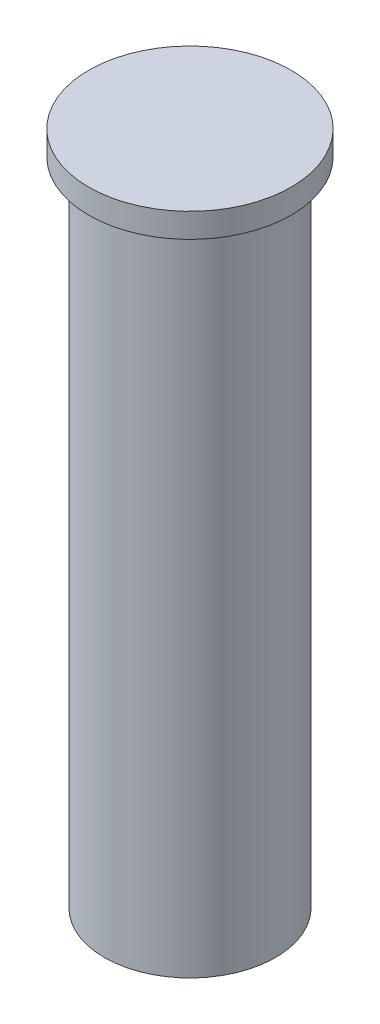
ISO-10303-21;
HEADER;
FILE_DESCRIPTION(('STEP AP214'),'2;1');
FILE_NAME('part.step','',(''),(''),'','','');
FILE_SCHEMA(('AUTOMOTIVE_DESIGN { 1 0 10303 214 1 1 1 1 }'));
ENDSEC;
DATA;
#1=APPLICATION_CONTEXT('core data for automotive mechanical design processes');
#2=APPLICATION_PROTOCOL_DEFINITION('international standard','automotive_design',2000,#1);
#3=PRODUCT_CONTEXT('',#1,'mechanical');
#4=PRODUCT('Part','Part','',(#3));
#5=PRODUCT_RELATED_PRODUCT_CATEGORY('part','',(#4));
#6=PRODUCT_DEFINITION_FORMATION('','',#4);
#7=PRODUCT_DEFINITION_CONTEXT('part definition',#1,'design');
#8=PRODUCT_DEFINITION('design','',#6,#7);
#9=PRODUCT_DEFINITION_SHAPE('','',#8);
#10=(LENGTH_UNIT() NAMED_UNIT(*) SI_UNIT(.MILLI.,.METRE.));
#11=(NAMED_UNIT(*) PLANE_ANGLE_UNIT() SI_UNIT($,.RADIAN.));
#12=(NAMED_UNIT(*) SI_UNIT($,.STERADIAN.) SOLID_ANGLE_UNIT());
#13=UNCERTAINTY_MEASURE_WITH_UNIT(LENGTH_MEASURE(1.E-05),#10,'distance_accuracy_value','');
#14=(GEOMETRIC_REPRESENTATION_CONTEXT(3) GLOBAL_UNCERTAINTY_ASSIGNED_CONTEXT((#13)) GLOBAL_UNIT_ASSIGNED_CONTEXT((#10,
#11,#12)) REPRESENTATION_CONTEXT('',''));
#15=CARTESIAN_POINT('',(0.,0.,0.));
#16=DIRECTION('',(0.,0.,1.));
#17=DIRECTION('',(1.,0.,0.));
#18=AXIS2_PLACEMENT_3D('',#15,#16,#17);
#19=CARTESIAN_POINT('',(0.,1.143,0.));
#20=DIRECTION('',(0.,-1.,0.));
#21=DIRECTION('',(0.,0.,-1.));
#22=AXIS2_PLACEMENT_3D('',#19,#20,#21);
#23=CYLINDRICAL_SURFACE('',#22,4.7625);
#24=CARTESIAN_POINT('',(0.,1.143,0.));
#25=DIRECTION('',(0.,1.,0.));
#26=DIRECTION('',(0.,0.,1.));
#27=AXIS2_PLACEMENT_3D('',#24,#25,#26);
#28=CIRCLE('',#27,4.7625);
#29=CARTESIAN_POINT('',(0.,1.143,4.7625));
#30=VERTEX_POINT('',#29);
#31=EDGE_CURVE('E13',#30,#30,#28,.T.);
#32=ORIENTED_EDGE('',*,*,#31,.F.);
#33=EDGE_LOOP('',(#32));
#34=FACE_BOUND('',#33,.T.);
#35=CARTESIAN_POINT('',(0.,0.,0.));
#36=DIRECTION('',(0.,1.,0.));
#37=DIRECTION('',(0.,0.,1.));
#38=AXIS2_PLACEMENT_3D('',#35,#36,#37);
#39=CIRCLE('',#38,4.7625);
#40=CARTESIAN_POINT('',(0.,0.,4.7625));
#41=VERTEX_POINT('',#40);
#42=EDGE_CURVE('E59',#41,#41,#39,.T.);
#43=ORIENTED_EDGE('',*,*,#42,.T.);
#44=EDGE_LOOP('',(#43));
#45=FACE_BOUND('',#44,.T.);
#46=ADVANCED_FACE('F52',(#34,#45),#23,.T.);
#47=CARTESIAN_POINT('',(0.,1.143,0.));
#48=DIRECTION('',(0.,1.,0.));
#49=DIRECTION('',(0.,0.,1.));
#50=AXIS2_PLACEMENT_3D('',#47,#48,#49);
#51=PLANE('',#50);
#52=ORIENTED_EDGE('',*,*,#31,.T.);
#53=EDGE_LOOP('',(#52));
#54=FACE_BOUND('',#53,.T.);
#55=ADVANCED_FACE('F101',(#54),#51,.T.);
#56=CARTESIAN_POINT('',(0.,0.,0.));
#57=DIRECTION('',(0.,1.,0.));
#58=DIRECTION('',(0.,0.,1.));
#59=AXIS2_PLACEMENT_3D('',#56,#57,#58);
#60=PLANE('',#59);
#61=CARTESIAN_POINT('',(0.,0.,0.));
#62=DIRECTION('',(0.,1.,0.));
#63=DIRECTION('',(0.,0.,1.));
#64=AXIS2_PLACEMENT_3D('',#61,#62,#63);
#65=CIRCLE('',#64,4.0259);
#66=CARTESIAN_POINT('',(0.,0.,4.0259));
#67=VERTEX_POINT('',#66);
#68=EDGE_CURVE('E55',#67,#67,#65,.T.);
#69=ORIENTED_EDGE('',*,*,#68,.T.);
#70=EDGE_LOOP('',(#69));
#71=FACE_BOUND('',#70,.T.);
#72=ORIENTED_EDGE('',*,*,#42,.F.);
#73=EDGE_LOOP('',(#72));
#74=FACE_BOUND('',#73,.T.);
#75=ADVANCED_FACE('F88',(#71,#74),#60,.F.);
#76=CARTESIAN_POINT('',(0.,-30.607,0.));
#77=DIRECTION('',(0.,1.,0.));
#78=DIRECTION('',(0.,0.,1.));
#79=AXIS2_PLACEMENT_3D('',#76,#77,#78);
#80=CYLINDRICAL_SURFACE('',#79,4.0259);
#81=CARTESIAN_POINT('',(0.,-30.607,0.));
#82=DIRECTION('',(0.,1.,0.));
#83=DIRECTION('',(0.,0.,1.));
#84=AXIS2_PLACEMENT_3D('',#81,#82,#83);
#85=CIRCLE('',#84,4.0259);
#86=CARTESIAN_POINT('',(0.,-30.607,4.0259));
#87=VERTEX_POINT('',#86);
#88=EDGE_CURVE('E73',#87,#87,#85,.T.);
#89=ORIENTED_EDGE('',*,*,#88,.T.);
#90=EDGE_LOOP('',(#89));
#91=FACE_BOUND('',#90,.T.);
#92=ORIENTED_EDGE('',*,*,#68,.F.);
#93=EDGE_LOOP('',(#92));
#94=FACE_BOUND('',#93,.T.);
#95=ADVANCED_FACE('F91',(#91,#94),#80,.T.);
#96=CARTESIAN_POINT('',(0.,-30.607,0.));
#97=DIRECTION('',(0.,1.,0.));
#98=DIRECTION('',(0.,0.,1.));
#99=AXIS2_PLACEMENT_3D('',#96,#97,#98);
#100=PLANE('',#99);
#101=CARTESIAN_POINT('',(0.,-30.607,0.));
#102=DIRECTION('',(0.,-1.,0.));
#103=DIRECTION('',(0.,0.,-1.));
#104=AXIS2_PLACEMENT_3D('',#101,#102,#103);
#105=CIRCLE('',#104,2.7178);
#106=CARTESIAN_POINT('',(0.,-30.607,-2.7178));
#107=VERTEX_POINT('',#106);
#108=EDGE_CURVE('E79',#107,#107,#105,.T.);
#109=ORIENTED_EDGE('',*,*,#108,.F.);
#110=EDGE_LOOP('',(#109));
#111=FACE_BOUND('',#110,.T.);
#112=ORIENTED_EDGE('',*,*,#88,.F.);
#113=EDGE_LOOP('',(#112));
#114=FACE_BOUND('',#113,.T.);
#115=ADVANCED_FACE('F67',(#111,#114),#100,.F.);
#116=CARTESIAN_POINT('',(0.,-11.557,0.));
#117=DIRECTION('',(0.,-1.,0.));
#118=DIRECTION('',(0.,0.,-1.));
#119=AXIS2_PLACEMENT_3D('',#116,#117,#118);
#120=CONICAL_SURFACE('',#119,1.7272,1.02974425867665);
#121=CARTESIAN_POINT('',(0.,-10.5191935388156,0.));
#122=VERTEX_POINT('',#121);
#123=VERTEX_LOOP('',#122);
#124=FACE_BOUND('',#123,.T.);
#125=CARTESIAN_POINT('',(0.,-11.557,0.));
#126=DIRECTION('',(0.,-1.,0.));
#127=DIRECTION('',(0.,0.,-1.));
#128=AXIS2_PLACEMENT_3D('',#125,#126,#127);
#129=CIRCLE('',#128,1.7272);
#130=CARTESIAN_POINT('',(0.,-11.557,-1.7272));
#131=VERTEX_POINT('',#130);
#132=EDGE_CURVE('E71',#131,#131,#129,.T.);
#133=ORIENTED_EDGE('',*,*,#132,.T.);
#134=EDGE_LOOP('',(#133));
#135=FACE_BOUND('',#134,.T.);
#136=ADVANCED_FACE('F63',(#124,#135),#120,.F.);
#137=CARTESIAN_POINT('',(0.,-30.607,0.));
#138=DIRECTION('',(0.,-1.,0.));
#139=DIRECTION('',(0.,0.,-1.));
#140=AXIS2_PLACEMENT_3D('',#137,#138,#139);
#141=CYLINDRICAL_SURFACE('',#140,1.7272);
#142=ORIENTED_EDGE('',*,*,#132,.F.);
#143=EDGE_LOOP('',(#142));
#144=FACE_BOUND('',#143,.T.);
#145=CARTESIAN_POINT('',(0.,-28.2154800451132,0.));
#146=DIRECTION('',(0.,-1.,0.));
#147=DIRECTION('',(0.,0.,-1.));
#148=AXIS2_PLACEMENT_3D('',#145,#146,#147);
#149=CIRCLE('',#148,1.7272);
#150=CARTESIAN_POINT('',(0.,-28.2154800451132,-1.7272));
#151=VERTEX_POINT('',#150);
#152=EDGE_CURVE('E74',#151,#151,#149,.T.);
#153=ORIENTED_EDGE('',*,*,#152,.T.);
#154=EDGE_LOOP('',(#153));
#155=FACE_BOUND('',#154,.T.);
#156=ADVANCED_FACE('F66',(#144,#155),#141,.F.);
#157=CARTESIAN_POINT('',(0.,-30.607,0.));
#158=DIRECTION('',(0.,-1.,0.));
#159=DIRECTION('',(0.,0.,-1.));
#160=AXIS2_PLACEMENT_3D('',#157,#158,#159);
#161=CONICAL_SURFACE('',#160,2.7178,0.392699081698724);
#162=ORIENTED_EDGE('',*,*,#152,.F.);
#163=EDGE_LOOP('',(#162));
#164=FACE_BOUND('',#163,.T.);
#165=ORIENTED_EDGE('',*,*,#108,.T.);
#166=EDGE_LOOP('',(#165));
#167=FACE_BOUND('',#166,.T.);
#168=ADVANCED_FACE('F142',(#164,#167),#161,.F.);
#169=CLOSED_SHELL('',(#46,#55,#75,#95,#115,#136,#156,#168));
#170=MANIFOLD_SOLID_BREP('B2',#169);
#171=ADVANCED_BREP_SHAPE_REPRESENTATION('',(#18,#170),#14);
#172=SHAPE_DEFINITION_REPRESENTATION(#9,#171);
ENDSEC;
END-ISO-10303-21;
